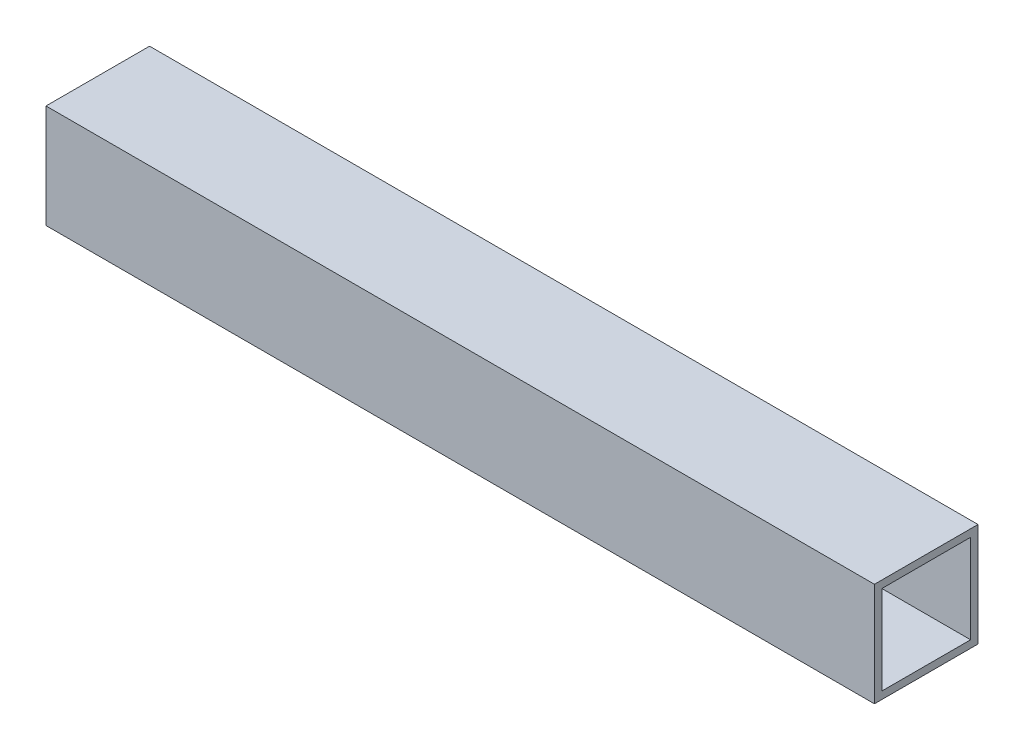
ISO-10303-21;
HEADER;
FILE_DESCRIPTION(('STEP AP214'),'2;1');
FILE_NAME('part.step','',(''),(''),'','','');
FILE_SCHEMA(('AUTOMOTIVE_DESIGN { 1 0 10303 214 1 1 1 1 }'));
ENDSEC;
DATA;
#1=APPLICATION_CONTEXT('core data for automotive mechanical design processes');
#2=APPLICATION_PROTOCOL_DEFINITION('international standard','automotive_design',2000,#1);
#3=PRODUCT_CONTEXT('',#1,'mechanical');
#4=PRODUCT('Part','Part','',(#3));
#5=PRODUCT_RELATED_PRODUCT_CATEGORY('part','',(#4));
#6=PRODUCT_DEFINITION_FORMATION('','',#4);
#7=PRODUCT_DEFINITION_CONTEXT('part definition',#1,'design');
#8=PRODUCT_DEFINITION('design','',#6,#7);
#9=PRODUCT_DEFINITION_SHAPE('','',#8);
#10=(LENGTH_UNIT() NAMED_UNIT(*) SI_UNIT(.MILLI.,.METRE.));
#11=(NAMED_UNIT(*) PLANE_ANGLE_UNIT() SI_UNIT($,.RADIAN.));
#12=(NAMED_UNIT(*) SI_UNIT($,.STERADIAN.) SOLID_ANGLE_UNIT());
#13=UNCERTAINTY_MEASURE_WITH_UNIT(LENGTH_MEASURE(1.E-05),#10,'distance_accuracy_value','');
#14=(GEOMETRIC_REPRESENTATION_CONTEXT(3) GLOBAL_UNCERTAINTY_ASSIGNED_CONTEXT((#13)) GLOBAL_UNIT_ASSIGNED_CONTEXT((#10,
#11,#12)) REPRESENTATION_CONTEXT('',''));
#15=CARTESIAN_POINT('',(0.,0.,0.));
#16=DIRECTION('',(0.,0.,1.));
#17=DIRECTION('',(1.,0.,0.));
#18=AXIS2_PLACEMENT_3D('',#15,#16,#17);
#19=CARTESIAN_POINT('',(177.8,0.,0.));
#20=DIRECTION('',(1.,0.,0.));
#21=DIRECTION('',(0.,0.,-1.));
#22=AXIS2_PLACEMENT_3D('',#19,#20,#21);
#23=PLANE('',#22);
#24=DIRECTION('',(0.,-1.,0.));
#25=VECTOR('',#24,1.);
#26=CARTESIAN_POINT('',(177.8,44.45,0.));
#27=LINE('',#26,#25);
#28=CARTESIAN_POINT('',(177.8,44.45,0.));
#29=VERTEX_POINT('',#28);
#30=CARTESIAN_POINT('',(177.8,0.,0.));
#31=VERTEX_POINT('',#30);
#32=EDGE_CURVE('E136',#29,#31,#27,.T.);
#33=ORIENTED_EDGE('',*,*,#32,.T.);
#34=DIRECTION('',(0.,0.,-1.));
#35=VECTOR('',#34,1.);
#36=CARTESIAN_POINT('',(177.8,0.,0.));
#37=LINE('',#36,#35);
#38=CARTESIAN_POINT('',(177.8,0.,-44.45));
#39=VERTEX_POINT('',#38);
#40=EDGE_CURVE('E139',#31,#39,#37,.T.);
#41=ORIENTED_EDGE('',*,*,#40,.T.);
#42=DIRECTION('',(0.,1.,0.));
#43=VECTOR('',#42,1.);
#44=CARTESIAN_POINT('',(177.8,0.,-44.45));
#45=LINE('',#44,#43);
#46=CARTESIAN_POINT('',(177.8,44.45,-44.45));
#47=VERTEX_POINT('',#46);
#48=EDGE_CURVE('E142',#39,#47,#45,.T.);
#49=ORIENTED_EDGE('',*,*,#48,.T.);
#50=DIRECTION('',(0.,0.,1.));
#51=VECTOR('',#50,1.);
#52=CARTESIAN_POINT('',(177.8,44.45,-44.45));
#53=LINE('',#52,#51);
#54=EDGE_CURVE('E144',#47,#29,#53,.T.);
#55=ORIENTED_EDGE('',*,*,#54,.T.);
#56=EDGE_LOOP('',(#33,#41,#49,#55));
#57=FACE_BOUND('',#56,.T.);
#58=DIRECTION('',(0.,0.,1.));
#59=VECTOR('',#58,1.);
#60=CARTESIAN_POINT('',(177.8,41.275,-41.275));
#61=LINE('',#60,#59);
#62=CARTESIAN_POINT('',(177.8,41.275,-41.275));
#63=VERTEX_POINT('',#62);
#64=CARTESIAN_POINT('',(177.8,41.275,-3.175));
#65=VERTEX_POINT('',#64);
#66=EDGE_CURVE('E108',#63,#65,#61,.T.);
#67=ORIENTED_EDGE('',*,*,#66,.F.);
#68=DIRECTION('',(0.,1.,0.));
#69=VECTOR('',#68,1.);
#70=CARTESIAN_POINT('',(177.8,3.175,-41.275));
#71=LINE('',#70,#69);
#72=CARTESIAN_POINT('',(177.8,3.175,-41.275));
#73=VERTEX_POINT('',#72);
#74=EDGE_CURVE('E100',#73,#63,#71,.T.);
#75=ORIENTED_EDGE('',*,*,#74,.F.);
#76=DIRECTION('',(0.,0.,-1.));
#77=VECTOR('',#76,1.);
#78=CARTESIAN_POINT('',(177.8,3.175,-3.17500000000001));
#79=LINE('',#78,#77);
#80=CARTESIAN_POINT('',(177.8,3.175,-3.17500000000001));
#81=VERTEX_POINT('',#80);
#82=EDGE_CURVE('E122',#81,#73,#79,.T.);
#83=ORIENTED_EDGE('',*,*,#82,.F.);
#84=DIRECTION('',(0.,-1.,0.));
#85=VECTOR('',#84,1.);
#86=CARTESIAN_POINT('',(177.8,41.275,-3.175));
#87=LINE('',#86,#85);
#88=EDGE_CURVE('E120',#65,#81,#87,.T.);
#89=ORIENTED_EDGE('',*,*,#88,.F.);
#90=EDGE_LOOP('',(#67,#75,#83,#89));
#91=FACE_BOUND('',#90,.T.);
#92=ADVANCED_FACE('F35',(#57,#91),#23,.T.);
#93=CARTESIAN_POINT('',(-177.8,0.,0.));
#94=DIRECTION('',(1.,0.,0.));
#95=DIRECTION('',(0.,0.,-1.));
#96=AXIS2_PLACEMENT_3D('',#93,#94,#95);
#97=PLANE('',#96);
#98=DIRECTION('',(0.,-1.,0.));
#99=VECTOR('',#98,1.);
#100=CARTESIAN_POINT('',(-177.8,44.45,0.));
#101=LINE('',#100,#99);
#102=CARTESIAN_POINT('',(-177.8,44.45,0.));
#103=VERTEX_POINT('',#102);
#104=CARTESIAN_POINT('',(-177.8,0.,0.));
#105=VERTEX_POINT('',#104);
#106=EDGE_CURVE('E116',#103,#105,#101,.T.);
#107=ORIENTED_EDGE('',*,*,#106,.F.);
#108=DIRECTION('',(0.,0.,1.));
#109=VECTOR('',#108,1.);
#110=CARTESIAN_POINT('',(-177.8,44.45,-44.45));
#111=LINE('',#110,#109);
#112=CARTESIAN_POINT('',(-177.8,44.45,-44.45));
#113=VERTEX_POINT('',#112);
#114=EDGE_CURVE('E140',#113,#103,#111,.T.);
#115=ORIENTED_EDGE('',*,*,#114,.F.);
#116=DIRECTION('',(0.,1.,0.));
#117=VECTOR('',#116,1.);
#118=CARTESIAN_POINT('',(-177.8,0.,-44.45));
#119=LINE('',#118,#117);
#120=CARTESIAN_POINT('',(-177.8,0.,-44.45));
#121=VERTEX_POINT('',#120);
#122=EDGE_CURVE('E151',#121,#113,#119,.T.);
#123=ORIENTED_EDGE('',*,*,#122,.F.);
#124=DIRECTION('',(0.,0.,-1.));
#125=VECTOR('',#124,1.);
#126=CARTESIAN_POINT('',(-177.8,0.,0.));
#127=LINE('',#126,#125);
#128=EDGE_CURVE('E149',#105,#121,#127,.T.);
#129=ORIENTED_EDGE('',*,*,#128,.F.);
#130=EDGE_LOOP('',(#107,#115,#123,#129));
#131=FACE_BOUND('',#130,.T.);
#132=DIRECTION('',(0.,1.,0.));
#133=VECTOR('',#132,1.);
#134=CARTESIAN_POINT('',(-177.8,3.175,-41.275));
#135=LINE('',#134,#133);
#136=CARTESIAN_POINT('',(-177.8,3.175,-41.275));
#137=VERTEX_POINT('',#136);
#138=CARTESIAN_POINT('',(-177.8,41.275,-41.275));
#139=VERTEX_POINT('',#138);
#140=EDGE_CURVE('E58',#137,#139,#135,.T.);
#141=ORIENTED_EDGE('',*,*,#140,.T.);
#142=DIRECTION('',(0.,0.,1.));
#143=VECTOR('',#142,1.);
#144=CARTESIAN_POINT('',(-177.8,41.275,-41.275));
#145=LINE('',#144,#143);
#146=CARTESIAN_POINT('',(-177.8,41.275,-3.175));
#147=VERTEX_POINT('',#146);
#148=EDGE_CURVE('E115',#139,#147,#145,.T.);
#149=ORIENTED_EDGE('',*,*,#148,.T.);
#150=DIRECTION('',(0.,-1.,0.));
#151=VECTOR('',#150,1.);
#152=CARTESIAN_POINT('',(-177.8,41.275,-3.175));
#153=LINE('',#152,#151);
#154=CARTESIAN_POINT('',(-177.8,3.175,-3.17500000000001));
#155=VERTEX_POINT('',#154);
#156=EDGE_CURVE('E128',#147,#155,#153,.T.);
#157=ORIENTED_EDGE('',*,*,#156,.T.);
#158=DIRECTION('',(0.,0.,-1.));
#159=VECTOR('',#158,1.);
#160=CARTESIAN_POINT('',(-177.8,3.175,-3.17500000000001));
#161=LINE('',#160,#159);
#162=EDGE_CURVE('E109',#155,#137,#161,.T.);
#163=ORIENTED_EDGE('',*,*,#162,.T.);
#164=EDGE_LOOP('',(#141,#149,#157,#163));
#165=FACE_BOUND('',#164,.T.);
#166=ADVANCED_FACE('F169',(#131,#165),#97,.F.);
#167=CARTESIAN_POINT('',(177.8,44.45,0.));
#168=DIRECTION('',(0.,0.,-1.));
#169=DIRECTION('',(0.,1.,0.));
#170=AXIS2_PLACEMENT_3D('',#167,#168,#169);
#171=PLANE('',#170);
#172=ORIENTED_EDGE('',*,*,#106,.T.);
#173=DIRECTION('',(-1.,0.,0.));
#174=VECTOR('',#173,1.);
#175=CARTESIAN_POINT('',(177.8,0.,0.));
#176=LINE('',#175,#174);
#177=EDGE_CURVE('E11',#31,#105,#176,.T.);
#178=ORIENTED_EDGE('',*,*,#177,.F.);
#179=ORIENTED_EDGE('',*,*,#32,.F.);
#180=DIRECTION('',(-1.,0.,0.));
#181=VECTOR('',#180,1.);
#182=CARTESIAN_POINT('',(177.8,44.45,0.));
#183=LINE('',#182,#181);
#184=EDGE_CURVE('E146',#29,#103,#183,.T.);
#185=ORIENTED_EDGE('',*,*,#184,.T.);
#186=EDGE_LOOP('',(#172,#178,#179,#185));
#187=FACE_BOUND('',#186,.T.);
#188=ADVANCED_FACE('F37',(#187),#171,.F.);
#189=CARTESIAN_POINT('',(177.8,0.,0.));
#190=DIRECTION('',(0.,1.,0.));
#191=DIRECTION('',(0.,0.,1.));
#192=AXIS2_PLACEMENT_3D('',#189,#190,#191);
#193=PLANE('',#192);
#194=ORIENTED_EDGE('',*,*,#128,.T.);
#195=DIRECTION('',(-1.,0.,0.));
#196=VECTOR('',#195,1.);
#197=CARTESIAN_POINT('',(177.8,0.,-44.45));
#198=LINE('',#197,#196);
#199=EDGE_CURVE('E43',#39,#121,#198,.T.);
#200=ORIENTED_EDGE('',*,*,#199,.F.);
#201=ORIENTED_EDGE('',*,*,#40,.F.);
#202=ORIENTED_EDGE('',*,*,#177,.T.);
#203=EDGE_LOOP('',(#194,#200,#201,#202));
#204=FACE_BOUND('',#203,.T.);
#205=ADVANCED_FACE('F179',(#204),#193,.F.);
#206=CARTESIAN_POINT('',(177.8,0.,-44.45));
#207=DIRECTION('',(0.,0.,1.));
#208=DIRECTION('',(0.,-1.,0.));
#209=AXIS2_PLACEMENT_3D('',#206,#207,#208);
#210=PLANE('',#209);
#211=ORIENTED_EDGE('',*,*,#122,.T.);
#212=DIRECTION('',(-1.,0.,0.));
#213=VECTOR('',#212,1.);
#214=CARTESIAN_POINT('',(177.8,44.45,-44.45));
#215=LINE('',#214,#213);
#216=EDGE_CURVE('E156',#47,#113,#215,.T.);
#217=ORIENTED_EDGE('',*,*,#216,.F.);
#218=ORIENTED_EDGE('',*,*,#48,.F.);
#219=ORIENTED_EDGE('',*,*,#199,.T.);
#220=EDGE_LOOP('',(#211,#217,#218,#219));
#221=FACE_BOUND('',#220,.T.);
#222=ADVANCED_FACE('F163',(#221),#210,.F.);
#223=CARTESIAN_POINT('',(177.8,44.45,-44.45));
#224=DIRECTION('',(0.,-1.,0.));
#225=DIRECTION('',(0.,0.,-1.));
#226=AXIS2_PLACEMENT_3D('',#223,#224,#225);
#227=PLANE('',#226);
#228=ORIENTED_EDGE('',*,*,#114,.T.);
#229=ORIENTED_EDGE('',*,*,#184,.F.);
#230=ORIENTED_EDGE('',*,*,#54,.F.);
#231=ORIENTED_EDGE('',*,*,#216,.T.);
#232=EDGE_LOOP('',(#228,#229,#230,#231));
#233=FACE_BOUND('',#232,.T.);
#234=ADVANCED_FACE('F173',(#233),#227,.F.);
#235=CARTESIAN_POINT('',(177.8,3.175,-41.275));
#236=DIRECTION('',(0.,0.,1.));
#237=DIRECTION('',(0.,-1.,0.));
#238=AXIS2_PLACEMENT_3D('',#235,#236,#237);
#239=PLANE('',#238);
#240=ORIENTED_EDGE('',*,*,#140,.F.);
#241=DIRECTION('',(-1.,0.,0.));
#242=VECTOR('',#241,1.);
#243=CARTESIAN_POINT('',(177.8,3.175,-41.275));
#244=LINE('',#243,#242);
#245=EDGE_CURVE('E104',#73,#137,#244,.T.);
#246=ORIENTED_EDGE('',*,*,#245,.F.);
#247=ORIENTED_EDGE('',*,*,#74,.T.);
#248=DIRECTION('',(-1.,0.,0.));
#249=VECTOR('',#248,1.);
#250=CARTESIAN_POINT('',(177.8,41.275,-41.275));
#251=LINE('',#250,#249);
#252=EDGE_CURVE('E103',#63,#139,#251,.T.);
#253=ORIENTED_EDGE('',*,*,#252,.T.);
#254=EDGE_LOOP('',(#240,#246,#247,#253));
#255=FACE_BOUND('',#254,.T.);
#256=ADVANCED_FACE('F102',(#255),#239,.T.);
#257=CARTESIAN_POINT('',(177.8,41.275,-41.275));
#258=DIRECTION('',(0.,-1.,0.));
#259=DIRECTION('',(0.,0.,-1.));
#260=AXIS2_PLACEMENT_3D('',#257,#258,#259);
#261=PLANE('',#260);
#262=ORIENTED_EDGE('',*,*,#148,.F.);
#263=ORIENTED_EDGE('',*,*,#252,.F.);
#264=ORIENTED_EDGE('',*,*,#66,.T.);
#265=DIRECTION('',(-1.,0.,0.));
#266=VECTOR('',#265,1.);
#267=CARTESIAN_POINT('',(177.8,41.275,-3.175));
#268=LINE('',#267,#266);
#269=EDGE_CURVE('E117',#65,#147,#268,.T.);
#270=ORIENTED_EDGE('',*,*,#269,.T.);
#271=EDGE_LOOP('',(#262,#263,#264,#270));
#272=FACE_BOUND('',#271,.T.);
#273=ADVANCED_FACE('F112',(#272),#261,.T.);
#274=CARTESIAN_POINT('',(177.8,41.275,-3.175));
#275=DIRECTION('',(0.,0.,-1.));
#276=DIRECTION('',(0.,1.,0.));
#277=AXIS2_PLACEMENT_3D('',#274,#275,#276);
#278=PLANE('',#277);
#279=ORIENTED_EDGE('',*,*,#156,.F.);
#280=ORIENTED_EDGE('',*,*,#269,.F.);
#281=ORIENTED_EDGE('',*,*,#88,.T.);
#282=DIRECTION('',(-1.,0.,0.));
#283=VECTOR('',#282,1.);
#284=CARTESIAN_POINT('',(177.8,3.175,-3.17500000000001));
#285=LINE('',#284,#283);
#286=EDGE_CURVE('E50',#81,#155,#285,.T.);
#287=ORIENTED_EDGE('',*,*,#286,.T.);
#288=EDGE_LOOP('',(#279,#280,#281,#287));
#289=FACE_BOUND('',#288,.T.);
#290=ADVANCED_FACE('F202',(#289),#278,.T.);
#291=CARTESIAN_POINT('',(177.8,3.175,-3.17500000000001));
#292=DIRECTION('',(0.,1.,0.));
#293=DIRECTION('',(0.,0.,1.));
#294=AXIS2_PLACEMENT_3D('',#291,#292,#293);
#295=PLANE('',#294);
#296=ORIENTED_EDGE('',*,*,#162,.F.);
#297=ORIENTED_EDGE('',*,*,#286,.F.);
#298=ORIENTED_EDGE('',*,*,#82,.T.);
#299=ORIENTED_EDGE('',*,*,#245,.T.);
#300=EDGE_LOOP('',(#296,#297,#298,#299));
#301=FACE_BOUND('',#300,.T.);
#302=ADVANCED_FACE('F206',(#301),#295,.T.);
#303=CLOSED_SHELL('',(#92,#166,#188,#205,#222,#234,#256,#273,#290,#302));
#304=MANIFOLD_SOLID_BREP('B2',#303);
#305=ADVANCED_BREP_SHAPE_REPRESENTATION('',(#18,#304),#14);
#306=SHAPE_DEFINITION_REPRESENTATION(#9,#305);
ENDSEC;
END-ISO-10303-21;
